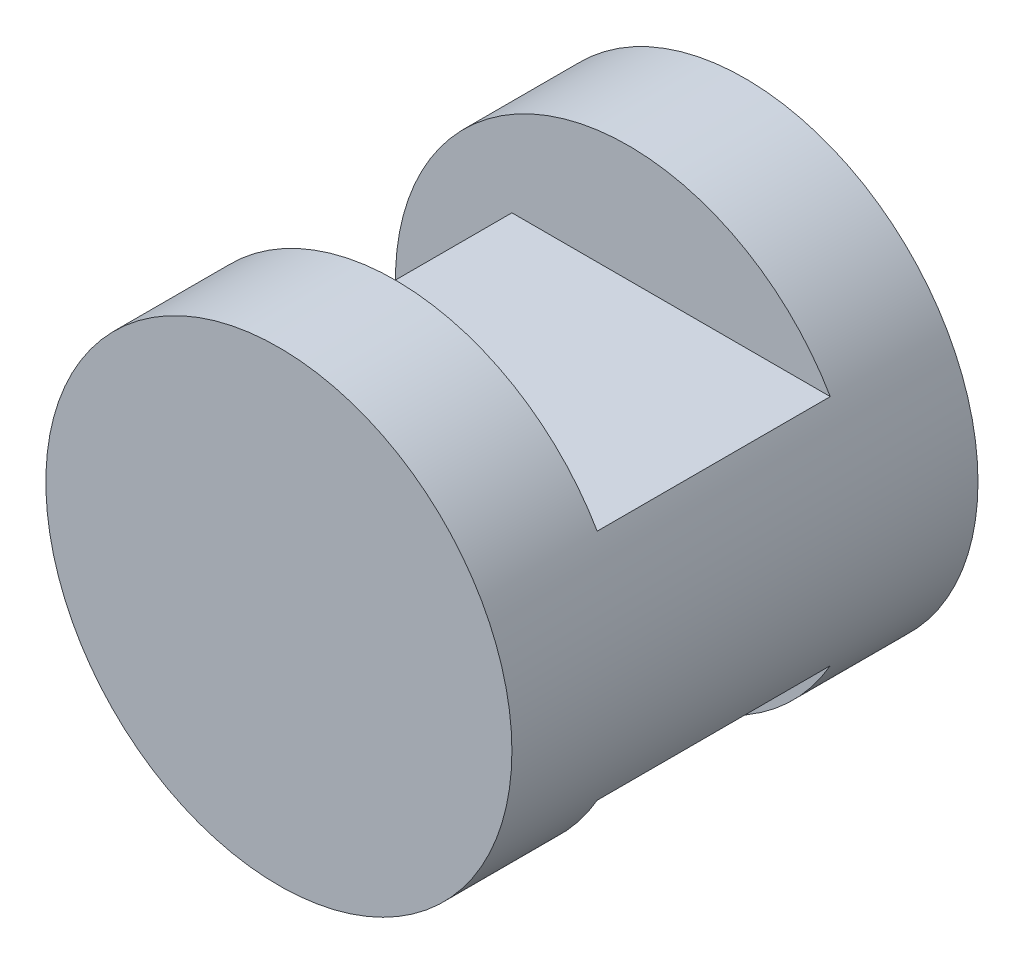
ISO-10303-21;
HEADER;
FILE_DESCRIPTION(('STEP AP214'),'2;1');
FILE_NAME('part.step','',(''),(''),'','','');
FILE_SCHEMA(('AUTOMOTIVE_DESIGN { 1 0 10303 214 1 1 1 1 }'));
ENDSEC;
DATA;
#1=APPLICATION_CONTEXT('core data for automotive mechanical design processes');
#2=APPLICATION_PROTOCOL_DEFINITION('international standard','automotive_design',2000,#1);
#3=PRODUCT_CONTEXT('',#1,'mechanical');
#4=PRODUCT('Part','Part','',(#3));
#5=PRODUCT_RELATED_PRODUCT_CATEGORY('part','',(#4));
#6=PRODUCT_DEFINITION_FORMATION('','',#4);
#7=PRODUCT_DEFINITION_CONTEXT('part definition',#1,'design');
#8=PRODUCT_DEFINITION('design','',#6,#7);
#9=PRODUCT_DEFINITION_SHAPE('','',#8);
#10=(LENGTH_UNIT() NAMED_UNIT(*) SI_UNIT(.MILLI.,.METRE.));
#11=(NAMED_UNIT(*) PLANE_ANGLE_UNIT() SI_UNIT($,.RADIAN.));
#12=(NAMED_UNIT(*) SI_UNIT($,.STERADIAN.) SOLID_ANGLE_UNIT());
#13=UNCERTAINTY_MEASURE_WITH_UNIT(LENGTH_MEASURE(1.E-05),#10,'distance_accuracy_value','');
#14=(GEOMETRIC_REPRESENTATION_CONTEXT(3) GLOBAL_UNCERTAINTY_ASSIGNED_CONTEXT((#13)) GLOBAL_UNIT_ASSIGNED_CONTEXT((#10,
#11,#12)) REPRESENTATION_CONTEXT('',''));
#15=CARTESIAN_POINT('',(0.,0.,0.));
#16=DIRECTION('',(0.,0.,1.));
#17=DIRECTION('',(1.,0.,0.));
#18=AXIS2_PLACEMENT_3D('',#15,#16,#17);
#19=CARTESIAN_POINT('',(0.,0.,40.));
#20=DIRECTION('',(0.,0.,-1.));
#21=DIRECTION('',(-1.,0.,0.));
#22=AXIS2_PLACEMENT_3D('',#19,#20,#21);
#23=CYLINDRICAL_SURFACE('',#22,20.);
#24=CARTESIAN_POINT('',(0.,0.,0.));
#25=DIRECTION('',(0.,0.,1.));
#26=DIRECTION('',(1.,0.,0.));
#27=AXIS2_PLACEMENT_3D('',#24,#25,#26);
#28=CIRCLE('',#27,20.);
#29=CARTESIAN_POINT('',(20.,0.,0.));
#30=VERTEX_POINT('',#29);
#31=EDGE_CURVE('E102',#30,#30,#28,.T.);
#32=ORIENTED_EDGE('',*,*,#31,.T.);
#33=EDGE_LOOP('',(#32));
#34=FACE_BOUND('',#33,.T.);
#35=CARTESIAN_POINT('',(0.,0.,40.));
#36=DIRECTION('',(0.,0.,1.));
#37=DIRECTION('',(1.,0.,0.));
#38=AXIS2_PLACEMENT_3D('',#35,#36,#37);
#39=CIRCLE('',#38,20.);
#40=CARTESIAN_POINT('',(20.,0.,40.));
#41=VERTEX_POINT('',#40);
#42=EDGE_CURVE('E81',#41,#41,#39,.T.);
#43=ORIENTED_EDGE('',*,*,#42,.F.);
#44=EDGE_LOOP('',(#43));
#45=FACE_BOUND('',#44,.T.);
#46=CARTESIAN_POINT('',(0.,0.,30.));
#47=DIRECTION('',(0.,0.,-1.));
#48=DIRECTION('',(-1.,0.,0.));
#49=AXIS2_PLACEMENT_3D('',#46,#47,#48);
#50=CIRCLE('',#49,20.);
#51=CARTESIAN_POINT('',(17.3205080756888,-10.,30.));
#52=VERTEX_POINT('',#51);
#53=CARTESIAN_POINT('',(17.3205080756888,10.,30.));
#54=VERTEX_POINT('',#53);
#55=EDGE_CURVE('E11',#52,#54,#50,.T.);
#56=ORIENTED_EDGE('',*,*,#55,.F.);
#57=DIRECTION('',(0.,0.,-1.));
#58=VECTOR('',#57,1.);
#59=CARTESIAN_POINT('',(17.3205080756888,-10.,40.));
#60=LINE('',#59,#58);
#61=CARTESIAN_POINT('',(17.3205080756888,-10.,10.));
#62=VERTEX_POINT('',#61);
#63=EDGE_CURVE('E83',#62,#52,#60,.F.);
#64=ORIENTED_EDGE('',*,*,#63,.F.);
#65=CARTESIAN_POINT('',(0.,0.,10.));
#66=DIRECTION('',(0.,0.,1.));
#67=DIRECTION('',(1.,0.,0.));
#68=AXIS2_PLACEMENT_3D('',#65,#66,#67);
#69=CIRCLE('',#68,20.);
#70=CARTESIAN_POINT('',(17.3205080756888,10.,10.));
#71=VERTEX_POINT('',#70);
#72=EDGE_CURVE('E40',#71,#62,#69,.T.);
#73=ORIENTED_EDGE('',*,*,#72,.F.);
#74=DIRECTION('',(0.,0.,-1.));
#75=VECTOR('',#74,1.);
#76=CARTESIAN_POINT('',(17.3205080756888,10.,40.));
#77=LINE('',#76,#75);
#78=EDGE_CURVE('E95',#54,#71,#77,.T.);
#79=ORIENTED_EDGE('',*,*,#78,.F.);
#80=EDGE_LOOP('',(#56,#64,#73,#79));
#81=FACE_BOUND('',#80,.T.);
#82=ADVANCED_FACE('F33',(#34,#45,#81),#23,.T.);
#83=CARTESIAN_POINT('',(-10.,40.,10.));
#84=DIRECTION('',(-1.,0.,0.));
#85=DIRECTION('',(0.,0.,1.));
#86=AXIS2_PLACEMENT_3D('',#83,#84,#85);
#87=PLANE('',#86);
#88=DIRECTION('',(0.,-1.,0.));
#89=VECTOR('',#88,1.);
#90=CARTESIAN_POINT('',(-10.,40.,10.));
#91=LINE('',#90,#89);
#92=CARTESIAN_POINT('',(-9.99999999999999,10.,10.));
#93=VERTEX_POINT('',#92);
#94=CARTESIAN_POINT('',(-9.99999999999999,-10.,10.));
#95=VERTEX_POINT('',#94);
#96=EDGE_CURVE('E97',#93,#95,#91,.T.);
#97=ORIENTED_EDGE('',*,*,#96,.T.);
#98=DIRECTION('',(0.,0.,1.));
#99=VECTOR('',#98,1.);
#100=CARTESIAN_POINT('',(-10.,-9.99999999999999,10.));
#101=LINE('',#100,#99);
#102=CARTESIAN_POINT('',(-9.99999999999999,-9.99999999999999,30.));
#103=VERTEX_POINT('',#102);
#104=EDGE_CURVE('E84',#95,#103,#101,.T.);
#105=ORIENTED_EDGE('',*,*,#104,.T.);
#106=DIRECTION('',(0.,-1.,0.));
#107=VECTOR('',#106,1.);
#108=CARTESIAN_POINT('',(-9.99999999999999,40.,30.));
#109=LINE('',#108,#107);
#110=CARTESIAN_POINT('',(-9.99999999999999,10.,30.));
#111=VERTEX_POINT('',#110);
#112=EDGE_CURVE('E99',#111,#103,#109,.T.);
#113=ORIENTED_EDGE('',*,*,#112,.F.);
#114=DIRECTION('',(0.,0.,-1.));
#115=VECTOR('',#114,1.);
#116=CARTESIAN_POINT('',(-10.,9.99999999999999,10.));
#117=LINE('',#116,#115);
#118=EDGE_CURVE('E93',#111,#93,#117,.T.);
#119=ORIENTED_EDGE('',*,*,#118,.T.);
#120=EDGE_LOOP('',(#97,#105,#113,#119));
#121=FACE_BOUND('',#120,.T.);
#122=ADVANCED_FACE('F120',(#121),#87,.T.);
#123=CARTESIAN_POINT('',(0.,0.,40.));
#124=DIRECTION('',(0.,0.,1.));
#125=DIRECTION('',(1.,0.,0.));
#126=AXIS2_PLACEMENT_3D('',#123,#124,#125);
#127=PLANE('',#126);
#128=ORIENTED_EDGE('',*,*,#42,.T.);
#129=EDGE_LOOP('',(#128));
#130=FACE_BOUND('',#129,.T.);
#131=ADVANCED_FACE('F113',(#130),#127,.T.);
#132=CARTESIAN_POINT('',(0.,0.,0.));
#133=DIRECTION('',(0.,0.,1.));
#134=DIRECTION('',(1.,0.,0.));
#135=AXIS2_PLACEMENT_3D('',#132,#133,#134);
#136=PLANE('',#135);
#137=ORIENTED_EDGE('',*,*,#31,.F.);
#138=EDGE_LOOP('',(#137));
#139=FACE_BOUND('',#138,.T.);
#140=ADVANCED_FACE('F110',(#139),#136,.F.);
#141=CARTESIAN_POINT('',(-20.,40.,30.));
#142=DIRECTION('',(0.,0.,-1.));
#143=DIRECTION('',(-1.,0.,0.));
#144=AXIS2_PLACEMENT_3D('',#141,#142,#143);
#145=PLANE('',#144);
#146=ORIENTED_EDGE('',*,*,#55,.T.);
#147=DIRECTION('',(-1.,0.,0.));
#148=VECTOR('',#147,1.);
#149=CARTESIAN_POINT('',(40.,10.,30.));
#150=LINE('',#149,#148);
#151=EDGE_CURVE('E87',#54,#111,#150,.T.);
#152=ORIENTED_EDGE('',*,*,#151,.T.);
#153=ORIENTED_EDGE('',*,*,#112,.T.);
#154=DIRECTION('',(-1.,0.,0.));
#155=VECTOR('',#154,1.);
#156=CARTESIAN_POINT('',(40.,-10.,30.));
#157=LINE('',#156,#155);
#158=EDGE_CURVE('E47',#52,#103,#157,.T.);
#159=ORIENTED_EDGE('',*,*,#158,.F.);
#160=EDGE_LOOP('',(#146,#152,#153,#159));
#161=FACE_BOUND('',#160,.T.);
#162=ADVANCED_FACE('F112',(#161),#145,.T.);
#163=CARTESIAN_POINT('',(-20.,40.,10.));
#164=DIRECTION('',(0.,0.,1.));
#165=DIRECTION('',(1.,0.,0.));
#166=AXIS2_PLACEMENT_3D('',#163,#164,#165);
#167=PLANE('',#166);
#168=ORIENTED_EDGE('',*,*,#72,.T.);
#169=DIRECTION('',(-1.,0.,0.));
#170=VECTOR('',#169,1.);
#171=CARTESIAN_POINT('',(40.,-10.,10.));
#172=LINE('',#171,#170);
#173=EDGE_CURVE('E76',#62,#95,#172,.T.);
#174=ORIENTED_EDGE('',*,*,#173,.T.);
#175=ORIENTED_EDGE('',*,*,#96,.F.);
#176=DIRECTION('',(-1.,0.,0.));
#177=VECTOR('',#176,1.);
#178=CARTESIAN_POINT('',(40.,10.,10.));
#179=LINE('',#178,#177);
#180=EDGE_CURVE('E55',#71,#93,#179,.T.);
#181=ORIENTED_EDGE('',*,*,#180,.F.);
#182=EDGE_LOOP('',(#168,#174,#175,#181));
#183=FACE_BOUND('',#182,.T.);
#184=ADVANCED_FACE('F74',(#183),#167,.T.);
#185=CARTESIAN_POINT('',(40.,10.,30.));
#186=DIRECTION('',(0.,1.,0.));
#187=DIRECTION('',(0.,0.,1.));
#188=AXIS2_PLACEMENT_3D('',#185,#186,#187);
#189=PLANE('',#188);
#190=ORIENTED_EDGE('',*,*,#78,.T.);
#191=ORIENTED_EDGE('',*,*,#180,.T.);
#192=ORIENTED_EDGE('',*,*,#118,.F.);
#193=ORIENTED_EDGE('',*,*,#151,.F.);
#194=EDGE_LOOP('',(#190,#191,#192,#193));
#195=FACE_BOUND('',#194,.T.);
#196=ADVANCED_FACE('F134',(#195),#189,.T.);
#197=CARTESIAN_POINT('',(40.,-10.,30.));
#198=DIRECTION('',(0.,-1.,0.));
#199=DIRECTION('',(0.,0.,-1.));
#200=AXIS2_PLACEMENT_3D('',#197,#198,#199);
#201=PLANE('',#200);
#202=ORIENTED_EDGE('',*,*,#63,.T.);
#203=ORIENTED_EDGE('',*,*,#158,.T.);
#204=ORIENTED_EDGE('',*,*,#104,.F.);
#205=ORIENTED_EDGE('',*,*,#173,.F.);
#206=EDGE_LOOP('',(#202,#203,#204,#205));
#207=FACE_BOUND('',#206,.T.);
#208=ADVANCED_FACE('F82',(#207),#201,.T.);
#209=CLOSED_SHELL('',(#82,#122,#131,#140,#162,#184,#196,#208));
#210=MANIFOLD_SOLID_BREP('B2',#209);
#211=ADVANCED_BREP_SHAPE_REPRESENTATION('',(#18,#210),#14);
#212=SHAPE_DEFINITION_REPRESENTATION(#9,#211);
ENDSEC;
END-ISO-10303-21;
